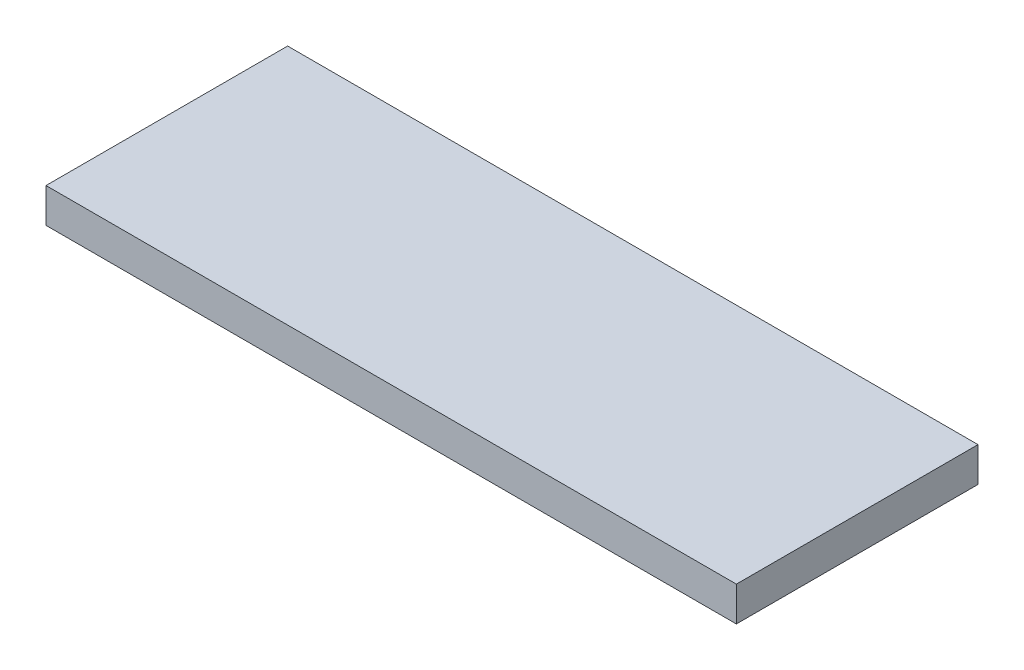
ISO-10303-21;
HEADER;
FILE_DESCRIPTION(('STEP AP214'),'2;1');
FILE_NAME('part.step','',(''),(''),'','','');
FILE_SCHEMA(('AUTOMOTIVE_DESIGN { 1 0 10303 214 1 1 1 1 }'));
ENDSEC;
DATA;
#1=APPLICATION_CONTEXT('core data for automotive mechanical design processes');
#2=APPLICATION_PROTOCOL_DEFINITION('international standard','automotive_design',2000,#1);
#3=PRODUCT_CONTEXT('',#1,'mechanical');
#4=PRODUCT('Part','Part','',(#3));
#5=PRODUCT_RELATED_PRODUCT_CATEGORY('part','',(#4));
#6=PRODUCT_DEFINITION_FORMATION('','',#4);
#7=PRODUCT_DEFINITION_CONTEXT('part definition',#1,'design');
#8=PRODUCT_DEFINITION('design','',#6,#7);
#9=PRODUCT_DEFINITION_SHAPE('','',#8);
#10=(LENGTH_UNIT() NAMED_UNIT(*) SI_UNIT(.MILLI.,.METRE.));
#11=(NAMED_UNIT(*) PLANE_ANGLE_UNIT() SI_UNIT($,.RADIAN.));
#12=(NAMED_UNIT(*) SI_UNIT($,.STERADIAN.) SOLID_ANGLE_UNIT());
#13=UNCERTAINTY_MEASURE_WITH_UNIT(LENGTH_MEASURE(1.E-05),#10,'distance_accuracy_value','');
#14=(GEOMETRIC_REPRESENTATION_CONTEXT(3) GLOBAL_UNCERTAINTY_ASSIGNED_CONTEXT((#13)) GLOBAL_UNIT_ASSIGNED_CONTEXT((#10,
#11,#12)) REPRESENTATION_CONTEXT('',''));
#15=CARTESIAN_POINT('',(0.,0.,0.));
#16=DIRECTION('',(0.,0.,1.));
#17=DIRECTION('',(1.,0.,0.));
#18=AXIS2_PLACEMENT_3D('',#15,#16,#17);
#19=CARTESIAN_POINT('',(63.5,6.35,22.225));
#20=DIRECTION('',(-1.,0.,0.));
#21=DIRECTION('',(0.,0.,1.));
#22=AXIS2_PLACEMENT_3D('',#19,#20,#21);
#23=PLANE('',#22);
#24=DIRECTION('',(0.,0.,-1.));
#25=VECTOR('',#24,1.);
#26=CARTESIAN_POINT('',(63.5,0.,22.225));
#27=LINE('',#26,#25);
#28=CARTESIAN_POINT('',(63.5,0.,22.225));
#29=VERTEX_POINT('',#28);
#30=CARTESIAN_POINT('',(63.5,0.,-22.225));
#31=VERTEX_POINT('',#30);
#32=EDGE_CURVE('E96',#29,#31,#27,.T.);
#33=ORIENTED_EDGE('',*,*,#32,.T.);
#34=DIRECTION('',(0.,-1.,0.));
#35=VECTOR('',#34,1.);
#36=CARTESIAN_POINT('',(63.5,6.35,-22.225));
#37=LINE('',#36,#35);
#38=CARTESIAN_POINT('',(63.5,6.35,-22.225));
#39=VERTEX_POINT('',#38);
#40=EDGE_CURVE('E11',#39,#31,#37,.T.);
#41=ORIENTED_EDGE('',*,*,#40,.F.);
#42=DIRECTION('',(0.,0.,-1.));
#43=VECTOR('',#42,1.);
#44=CARTESIAN_POINT('',(63.5,6.35,22.225));
#45=LINE('',#44,#43);
#46=CARTESIAN_POINT('',(63.5,6.35,22.225));
#47=VERTEX_POINT('',#46);
#48=EDGE_CURVE('E84',#47,#39,#45,.T.);
#49=ORIENTED_EDGE('',*,*,#48,.F.);
#50=DIRECTION('',(0.,-1.,0.));
#51=VECTOR('',#50,1.);
#52=CARTESIAN_POINT('',(63.5,6.35,22.225));
#53=LINE('',#52,#51);
#54=EDGE_CURVE('E92',#47,#29,#53,.T.);
#55=ORIENTED_EDGE('',*,*,#54,.T.);
#56=EDGE_LOOP('',(#33,#41,#49,#55));
#57=FACE_BOUND('',#56,.T.);
#58=ADVANCED_FACE('F33',(#57),#23,.F.);
#59=CARTESIAN_POINT('',(-63.5,6.35,-22.225));
#60=DIRECTION('',(0.,0.,1.));
#61=DIRECTION('',(1.,0.,0.));
#62=AXIS2_PLACEMENT_3D('',#59,#60,#61);
#63=PLANE('',#62);
#64=DIRECTION('',(-1.,0.,0.));
#65=VECTOR('',#64,1.);
#66=CARTESIAN_POINT('',(-63.5,0.,-22.225));
#67=LINE('',#66,#65);
#68=CARTESIAN_POINT('',(-63.5,0.,-22.225));
#69=VERTEX_POINT('',#68);
#70=EDGE_CURVE('E88',#31,#69,#67,.T.);
#71=ORIENTED_EDGE('',*,*,#70,.T.);
#72=DIRECTION('',(0.,-1.,0.));
#73=VECTOR('',#72,1.);
#74=CARTESIAN_POINT('',(-63.5,6.35,-22.225));
#75=LINE('',#74,#73);
#76=CARTESIAN_POINT('',(-63.5,6.35,-22.225));
#77=VERTEX_POINT('',#76);
#78=EDGE_CURVE('E41',#77,#69,#75,.T.);
#79=ORIENTED_EDGE('',*,*,#78,.F.);
#80=DIRECTION('',(-1.,0.,0.));
#81=VECTOR('',#80,1.);
#82=CARTESIAN_POINT('',(-63.5,6.35,-22.225));
#83=LINE('',#82,#81);
#84=EDGE_CURVE('E79',#39,#77,#83,.T.);
#85=ORIENTED_EDGE('',*,*,#84,.F.);
#86=ORIENTED_EDGE('',*,*,#40,.T.);
#87=EDGE_LOOP('',(#71,#79,#85,#86));
#88=FACE_BOUND('',#87,.T.);
#89=ADVANCED_FACE('F87',(#88),#63,.F.);
#90=CARTESIAN_POINT('',(-63.5,6.35,22.225));
#91=DIRECTION('',(1.,0.,0.));
#92=DIRECTION('',(0.,0.,-1.));
#93=AXIS2_PLACEMENT_3D('',#90,#91,#92);
#94=PLANE('',#93);
#95=DIRECTION('',(0.,0.,1.));
#96=VECTOR('',#95,1.);
#97=CARTESIAN_POINT('',(-63.5,0.,22.225));
#98=LINE('',#97,#96);
#99=CARTESIAN_POINT('',(-63.5,0.,22.225));
#100=VERTEX_POINT('',#99);
#101=EDGE_CURVE('E66',#69,#100,#98,.T.);
#102=ORIENTED_EDGE('',*,*,#101,.T.);
#103=DIRECTION('',(0.,-1.,0.));
#104=VECTOR('',#103,1.);
#105=CARTESIAN_POINT('',(-63.5,6.35,22.225));
#106=LINE('',#105,#104);
#107=CARTESIAN_POINT('',(-63.5,6.35,22.225));
#108=VERTEX_POINT('',#107);
#109=EDGE_CURVE('E89',#108,#100,#106,.T.);
#110=ORIENTED_EDGE('',*,*,#109,.F.);
#111=DIRECTION('',(0.,0.,1.));
#112=VECTOR('',#111,1.);
#113=CARTESIAN_POINT('',(-63.5,6.35,22.225));
#114=LINE('',#113,#112);
#115=EDGE_CURVE('E82',#77,#108,#114,.T.);
#116=ORIENTED_EDGE('',*,*,#115,.F.);
#117=ORIENTED_EDGE('',*,*,#78,.T.);
#118=EDGE_LOOP('',(#102,#110,#116,#117));
#119=FACE_BOUND('',#118,.T.);
#120=ADVANCED_FACE('F90',(#119),#94,.F.);
#121=CARTESIAN_POINT('',(-63.5,6.35,22.225));
#122=DIRECTION('',(0.,0.,-1.));
#123=DIRECTION('',(-1.,0.,0.));
#124=AXIS2_PLACEMENT_3D('',#121,#122,#123);
#125=PLANE('',#124);
#126=DIRECTION('',(1.,0.,0.));
#127=VECTOR('',#126,1.);
#128=CARTESIAN_POINT('',(-63.5,0.,22.225));
#129=LINE('',#128,#127);
#130=EDGE_CURVE('E72',#100,#29,#129,.T.);
#131=ORIENTED_EDGE('',*,*,#130,.T.);
#132=ORIENTED_EDGE('',*,*,#54,.F.);
#133=DIRECTION('',(1.,0.,0.));
#134=VECTOR('',#133,1.);
#135=CARTESIAN_POINT('',(-63.5,6.35,22.225));
#136=LINE('',#135,#134);
#137=EDGE_CURVE('E49',#108,#47,#136,.T.);
#138=ORIENTED_EDGE('',*,*,#137,.F.);
#139=ORIENTED_EDGE('',*,*,#109,.T.);
#140=EDGE_LOOP('',(#131,#132,#138,#139));
#141=FACE_BOUND('',#140,.T.);
#142=ADVANCED_FACE('F103',(#141),#125,.F.);
#143=CARTESIAN_POINT('',(0.,6.35,0.));
#144=DIRECTION('',(0.,-1.,0.));
#145=DIRECTION('',(0.,0.,-1.));
#146=AXIS2_PLACEMENT_3D('',#143,#144,#145);
#147=PLANE('',#146);
#148=ORIENTED_EDGE('',*,*,#48,.T.);
#149=ORIENTED_EDGE('',*,*,#84,.T.);
#150=ORIENTED_EDGE('',*,*,#115,.T.);
#151=ORIENTED_EDGE('',*,*,#137,.T.);
#152=EDGE_LOOP('',(#148,#149,#150,#151));
#153=FACE_BOUND('',#152,.T.);
#154=ADVANCED_FACE('F80',(#153),#147,.F.);
#155=CARTESIAN_POINT('',(0.,0.,0.));
#156=DIRECTION('',(0.,-1.,0.));
#157=DIRECTION('',(0.,0.,-1.));
#158=AXIS2_PLACEMENT_3D('',#155,#156,#157);
#159=PLANE('',#158);
#160=ORIENTED_EDGE('',*,*,#32,.F.);
#161=ORIENTED_EDGE('',*,*,#130,.F.);
#162=ORIENTED_EDGE('',*,*,#101,.F.);
#163=ORIENTED_EDGE('',*,*,#70,.F.);
#164=EDGE_LOOP('',(#160,#161,#162,#163));
#165=FACE_BOUND('',#164,.T.);
#166=ADVANCED_FACE('F106',(#165),#159,.T.);
#167=CLOSED_SHELL('',(#58,#89,#120,#142,#154,#166));
#168=MANIFOLD_SOLID_BREP('B2',#167);
#169=ADVANCED_BREP_SHAPE_REPRESENTATION('',(#18,#168),#14);
#170=SHAPE_DEFINITION_REPRESENTATION(#9,#169);
ENDSEC;
END-ISO-10303-21;
